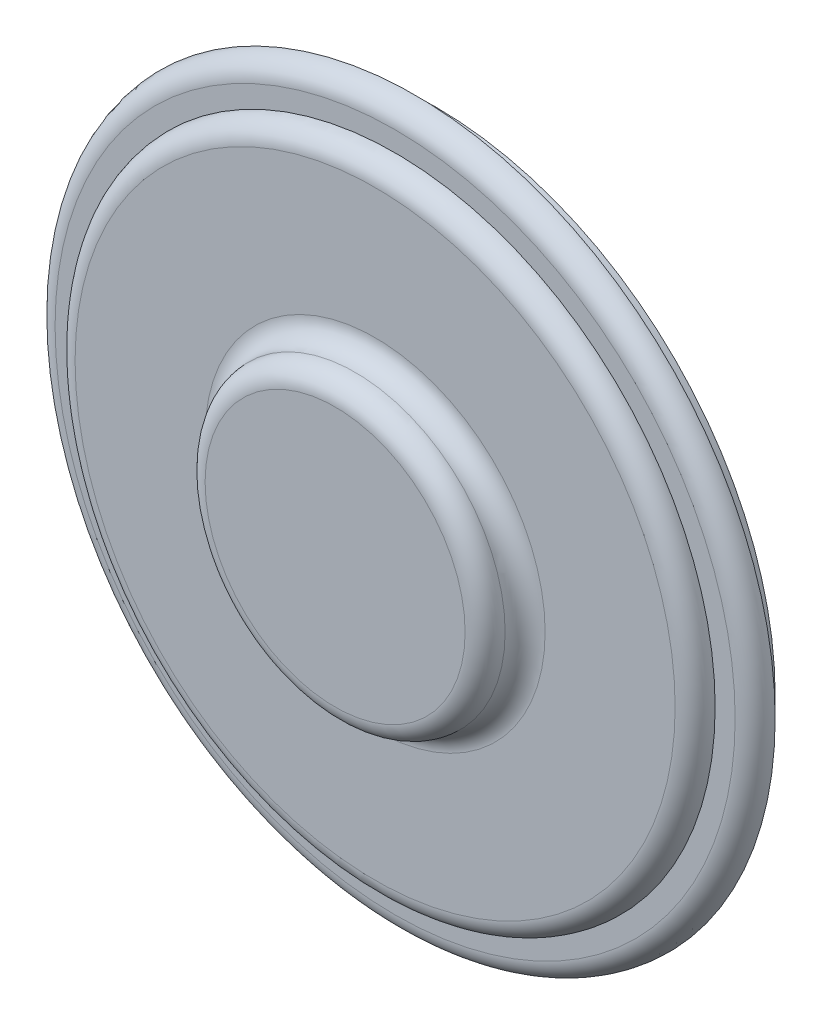
ISO-10303-21;
HEADER;
FILE_DESCRIPTION(('STEP AP214'),'2;1');
FILE_NAME('part.step','',(''),(''),'','','');
FILE_SCHEMA(('AUTOMOTIVE_DESIGN { 1 0 10303 214 1 1 1 1 }'));
ENDSEC;
DATA;
#1=APPLICATION_CONTEXT('core data for automotive mechanical design processes');
#2=APPLICATION_PROTOCOL_DEFINITION('international standard','automotive_design',2000,#1);
#3=PRODUCT_CONTEXT('',#1,'mechanical');
#4=PRODUCT('Part','Part','',(#3));
#5=PRODUCT_RELATED_PRODUCT_CATEGORY('part','',(#4));
#6=PRODUCT_DEFINITION_FORMATION('','',#4);
#7=PRODUCT_DEFINITION_CONTEXT('part definition',#1,'design');
#8=PRODUCT_DEFINITION('design','',#6,#7);
#9=PRODUCT_DEFINITION_SHAPE('','',#8);
#10=(LENGTH_UNIT() NAMED_UNIT(*) SI_UNIT(.MILLI.,.METRE.));
#11=(NAMED_UNIT(*) PLANE_ANGLE_UNIT() SI_UNIT($,.RADIAN.));
#12=(NAMED_UNIT(*) SI_UNIT($,.STERADIAN.) SOLID_ANGLE_UNIT());
#13=UNCERTAINTY_MEASURE_WITH_UNIT(LENGTH_MEASURE(1.E-05),#10,'distance_accuracy_value','');
#14=(GEOMETRIC_REPRESENTATION_CONTEXT(3) GLOBAL_UNCERTAINTY_ASSIGNED_CONTEXT((#13)) GLOBAL_UNIT_ASSIGNED_CONTEXT((#10,
#11,#12)) REPRESENTATION_CONTEXT('',''));
#15=CARTESIAN_POINT('',(0.,0.,0.));
#16=DIRECTION('',(0.,0.,1.));
#17=DIRECTION('',(1.,0.,0.));
#18=AXIS2_PLACEMENT_3D('',#15,#16,#17);
#19=CARTESIAN_POINT('',(0.,0.,2.));
#20=DIRECTION('',(0.,0.,1.));
#21=DIRECTION('',(1.,0.,0.));
#22=AXIS2_PLACEMENT_3D('',#19,#20,#21);
#23=PLANE('',#22);
#24=CARTESIAN_POINT('',(0.,0.,2.));
#25=DIRECTION('',(0.,0.,1.));
#26=DIRECTION('',(1.,0.,0.));
#27=AXIS2_PLACEMENT_3D('',#24,#25,#26);
#28=CIRCLE('',#27,17.);
#29=CARTESIAN_POINT('',(17.,0.,2.));
#30=VERTEX_POINT('',#29);
#31=EDGE_CURVE('E51',#30,#30,#28,.T.);
#32=ORIENTED_EDGE('',*,*,#31,.T.);
#33=EDGE_LOOP('',(#32));
#34=FACE_BOUND('',#33,.T.);
#35=CARTESIAN_POINT('',(0.,0.,2.));
#36=DIRECTION('',(0.,0.,1.));
#37=DIRECTION('',(1.,0.,0.));
#38=AXIS2_PLACEMENT_3D('',#35,#36,#37);
#39=CIRCLE('',#38,16.);
#40=CARTESIAN_POINT('',(16.,0.,2.));
#41=VERTEX_POINT('',#40);
#42=EDGE_CURVE('E60',#41,#41,#39,.T.);
#43=ORIENTED_EDGE('',*,*,#42,.F.);
#44=EDGE_LOOP('',(#43));
#45=FACE_BOUND('',#44,.T.);
#46=ADVANCED_FACE('F39',(#34,#45),#23,.T.);
#47=CARTESIAN_POINT('',(0.,0.,3.));
#48=DIRECTION('',(0.,0.,1.));
#49=DIRECTION('',(1.,0.,0.));
#50=AXIS2_PLACEMENT_3D('',#47,#48,#49);
#51=PLANE('',#50);
#52=CARTESIAN_POINT('',(0.,0.,3.));
#53=DIRECTION('',(0.,0.,1.));
#54=DIRECTION('',(1.,0.,0.));
#55=AXIS2_PLACEMENT_3D('',#52,#53,#54);
#56=CIRCLE('',#55,15.);
#57=CARTESIAN_POINT('',(15.,0.,3.));
#58=VERTEX_POINT('',#57);
#59=EDGE_CURVE('E65',#58,#58,#56,.T.);
#60=ORIENTED_EDGE('',*,*,#59,.T.);
#61=EDGE_LOOP('',(#60));
#62=FACE_BOUND('',#61,.T.);
#63=CARTESIAN_POINT('',(0.,0.,3.));
#64=DIRECTION('',(0.,0.,1.));
#65=DIRECTION('',(1.,0.,0.));
#66=AXIS2_PLACEMENT_3D('',#63,#64,#65);
#67=CIRCLE('',#66,8.5);
#68=CARTESIAN_POINT('',(8.5,0.,3.));
#69=VERTEX_POINT('',#68);
#70=EDGE_CURVE('E68',#69,#69,#67,.F.);
#71=ORIENTED_EDGE('',*,*,#70,.T.);
#72=EDGE_LOOP('',(#71));
#73=FACE_BOUND('',#72,.T.);
#74=ADVANCED_FACE('F118',(#62,#73),#51,.T.);
#75=CARTESIAN_POINT('',(0.,0.,5.));
#76=DIRECTION('',(0.,0.,1.));
#77=DIRECTION('',(1.,0.,0.));
#78=AXIS2_PLACEMENT_3D('',#75,#76,#77);
#79=PLANE('',#78);
#80=CARTESIAN_POINT('',(0.,0.,5.));
#81=DIRECTION('',(0.,0.,1.));
#82=DIRECTION('',(1.,0.,0.));
#83=AXIS2_PLACEMENT_3D('',#80,#81,#82);
#84=CIRCLE('',#83,6.5);
#85=CARTESIAN_POINT('',(6.5,0.,5.));
#86=VERTEX_POINT('',#85);
#87=EDGE_CURVE('E55',#86,#86,#84,.T.);
#88=ORIENTED_EDGE('',*,*,#87,.T.);
#89=EDGE_LOOP('',(#88));
#90=FACE_BOUND('',#89,.T.);
#91=ADVANCED_FACE('F124',(#90),#79,.T.);
#92=CARTESIAN_POINT('',(0.,0.,2.));
#93=DIRECTION('',(0.,0.,1.));
#94=DIRECTION('',(1.,0.,0.));
#95=AXIS2_PLACEMENT_3D('',#92,#93,#94);
#96=TOROIDAL_SURFACE('',#95,15.,1.);
#97=ORIENTED_EDGE('',*,*,#42,.T.);
#98=EDGE_LOOP('',(#97));
#99=FACE_BOUND('',#98,.T.);
#100=ORIENTED_EDGE('',*,*,#59,.F.);
#101=EDGE_LOOP('',(#100));
#102=FACE_BOUND('',#101,.T.);
#103=ADVANCED_FACE('F134',(#99,#102),#96,.T.);
#104=CARTESIAN_POINT('',(0.,0.,4.));
#105=DIRECTION('',(0.,0.,1.));
#106=DIRECTION('',(1.,0.,0.));
#107=AXIS2_PLACEMENT_3D('',#104,#105,#106);
#108=TOROIDAL_SURFACE('',#107,6.5,1.);
#109=ORIENTED_EDGE('',*,*,#87,.F.);
#110=EDGE_LOOP('',(#109));
#111=FACE_BOUND('',#110,.T.);
#112=CARTESIAN_POINT('',(0.,0.,4.));
#113=DIRECTION('',(0.,0.,1.));
#114=DIRECTION('',(1.,0.,0.));
#115=AXIS2_PLACEMENT_3D('',#112,#113,#114);
#116=CIRCLE('',#115,7.5);
#117=CARTESIAN_POINT('',(7.5,0.,4.));
#118=VERTEX_POINT('',#117);
#119=EDGE_CURVE('E58',#118,#118,#116,.F.);
#120=ORIENTED_EDGE('',*,*,#119,.F.);
#121=EDGE_LOOP('',(#120));
#122=FACE_BOUND('',#121,.T.);
#123=ADVANCED_FACE('F137',(#111,#122),#108,.T.);
#124=CARTESIAN_POINT('',(0.,0.,4.));
#125=DIRECTION('',(0.,0.,1.));
#126=DIRECTION('',(1.,0.,0.));
#127=AXIS2_PLACEMENT_3D('',#124,#125,#126);
#128=TOROIDAL_SURFACE('',#127,8.5,1.);
#129=ORIENTED_EDGE('',*,*,#70,.F.);
#130=EDGE_LOOP('',(#129));
#131=FACE_BOUND('',#130,.T.);
#132=ORIENTED_EDGE('',*,*,#119,.T.);
#133=EDGE_LOOP('',(#132));
#134=FACE_BOUND('',#133,.T.);
#135=ADVANCED_FACE('F139',(#131,#134),#128,.F.);
#136=CARTESIAN_POINT('',(0.,0.,1.));
#137=DIRECTION('',(0.,0.,1.));
#138=DIRECTION('',(1.,0.,0.));
#139=AXIS2_PLACEMENT_3D('',#136,#137,#138);
#140=TOROIDAL_SURFACE('',#139,17.,1.);
#141=CARTESIAN_POINT('',(0.,0.,1.));
#142=DIRECTION('',(0.,0.,-1.));
#143=DIRECTION('',(-1.,0.,0.));
#144=AXIS2_PLACEMENT_3D('',#141,#142,#143);
#145=CIRCLE('',#144,18.);
#146=CARTESIAN_POINT('',(-18.,0.,1.));
#147=VERTEX_POINT('',#146);
#148=EDGE_CURVE('E61',#147,#147,#145,.T.);
#149=ORIENTED_EDGE('',*,*,#148,.F.);
#150=EDGE_LOOP('',(#149));
#151=FACE_BOUND('',#150,.T.);
#152=ORIENTED_EDGE('',*,*,#31,.F.);
#153=EDGE_LOOP('',(#152));
#154=FACE_BOUND('',#153,.T.);
#155=ADVANCED_FACE('F142',(#151,#154),#140,.T.);
#156=CARTESIAN_POINT('',(0.,0.,1.));
#157=DIRECTION('',(0.,0.,-1.));
#158=DIRECTION('',(-1.,0.,0.));
#159=AXIS2_PLACEMENT_3D('',#156,#157,#158);
#160=PLANE('',#159);
#161=CARTESIAN_POINT('',(0.,0.,1.));
#162=DIRECTION('',(0.,0.,-1.));
#163=DIRECTION('',(-1.,0.,0.));
#164=AXIS2_PLACEMENT_3D('',#161,#162,#163);
#165=CIRCLE('',#164,17.);
#166=CARTESIAN_POINT('',(-17.,0.,1.));
#167=VERTEX_POINT('',#166);
#168=EDGE_CURVE('E75',#167,#167,#165,.T.);
#169=ORIENTED_EDGE('',*,*,#168,.F.);
#170=EDGE_LOOP('',(#169));
#171=FACE_BOUND('',#170,.T.);
#172=ORIENTED_EDGE('',*,*,#148,.T.);
#173=EDGE_LOOP('',(#172));
#174=FACE_BOUND('',#173,.T.);
#175=ADVANCED_FACE('F148',(#171,#174),#160,.T.);
#176=CARTESIAN_POINT('',(0.,0.,1.));
#177=DIRECTION('',(0.,0.,-1.));
#178=DIRECTION('',(-1.,0.,0.));
#179=AXIS2_PLACEMENT_3D('',#176,#177,#178);
#180=CYLINDRICAL_SURFACE('',#179,17.);
#181=ORIENTED_EDGE('',*,*,#168,.T.);
#182=EDGE_LOOP('',(#181));
#183=FACE_BOUND('',#182,.T.);
#184=CARTESIAN_POINT('',(0.,0.,0.));
#185=DIRECTION('',(0.,0.,-1.));
#186=DIRECTION('',(-1.,0.,0.));
#187=AXIS2_PLACEMENT_3D('',#184,#185,#186);
#188=CIRCLE('',#187,17.);
#189=CARTESIAN_POINT('',(-17.,0.,0.));
#190=VERTEX_POINT('',#189);
#191=EDGE_CURVE('E76',#190,#190,#188,.T.);
#192=ORIENTED_EDGE('',*,*,#191,.F.);
#193=EDGE_LOOP('',(#192));
#194=FACE_BOUND('',#193,.T.);
#195=ADVANCED_FACE('F132',(#183,#194),#180,.T.);
#196=CARTESIAN_POINT('',(0.,0.,0.));
#197=DIRECTION('',(0.,0.,1.));
#198=DIRECTION('',(1.,0.,0.));
#199=AXIS2_PLACEMENT_3D('',#196,#197,#198);
#200=PLANE('',#199);
#201=CARTESIAN_POINT('',(0.,0.,0.));
#202=DIRECTION('',(0.,0.,-1.));
#203=DIRECTION('',(-1.,0.,0.));
#204=AXIS2_PLACEMENT_3D('',#201,#202,#203);
#205=CIRCLE('',#204,15.7894607509045);
#206=CARTESIAN_POINT('',(-15.7894607509045,0.,0.));
#207=VERTEX_POINT('',#206);
#208=EDGE_CURVE('E82',#207,#207,#205,.T.);
#209=ORIENTED_EDGE('',*,*,#208,.F.);
#210=EDGE_LOOP('',(#209));
#211=FACE_BOUND('',#210,.T.);
#212=ORIENTED_EDGE('',*,*,#191,.T.);
#213=EDGE_LOOP('',(#212));
#214=FACE_BOUND('',#213,.T.);
#215=ADVANCED_FACE('F113',(#211,#214),#200,.F.);
#216=CARTESIAN_POINT('',(0.,0.,1.));
#217=DIRECTION('',(0.,0.,-1.));
#218=DIRECTION('',(-1.,0.,0.));
#219=AXIS2_PLACEMENT_3D('',#216,#217,#218);
#220=CYLINDRICAL_SURFACE('',#219,15.7894607509045);
#221=CARTESIAN_POINT('',(0.,0.,1.));
#222=DIRECTION('',(0.,0.,-1.));
#223=DIRECTION('',(-1.,0.,0.));
#224=AXIS2_PLACEMENT_3D('',#221,#222,#223);
#225=CIRCLE('',#224,15.7894607509045);
#226=CARTESIAN_POINT('',(-15.7894607509045,0.,1.));
#227=VERTEX_POINT('',#226);
#228=EDGE_CURVE('E79',#227,#227,#225,.T.);
#229=ORIENTED_EDGE('',*,*,#228,.F.);
#230=EDGE_LOOP('',(#229));
#231=FACE_BOUND('',#230,.T.);
#232=ORIENTED_EDGE('',*,*,#208,.T.);
#233=EDGE_LOOP('',(#232));
#234=FACE_BOUND('',#233,.T.);
#235=ADVANCED_FACE('F131',(#231,#234),#220,.F.);
#236=CARTESIAN_POINT('',(0.,0.,1.));
#237=DIRECTION('',(0.,0.,-1.));
#238=DIRECTION('',(-1.,0.,0.));
#239=AXIS2_PLACEMENT_3D('',#236,#237,#238);
#240=PLANE('',#239);
#241=CARTESIAN_POINT('',(0.,0.,1.));
#242=DIRECTION('',(0.,0.,-1.));
#243=DIRECTION('',(-1.,0.,0.));
#244=AXIS2_PLACEMENT_3D('',#241,#242,#243);
#245=CIRCLE('',#244,13.9322350829918);
#246=CARTESIAN_POINT('',(-13.9322350829918,0.,1.));
#247=VERTEX_POINT('',#246);
#248=EDGE_CURVE('E85',#247,#247,#245,.T.);
#249=ORIENTED_EDGE('',*,*,#248,.F.);
#250=EDGE_LOOP('',(#249));
#251=FACE_BOUND('',#250,.T.);
#252=ORIENTED_EDGE('',*,*,#228,.T.);
#253=EDGE_LOOP('',(#252));
#254=FACE_BOUND('',#253,.T.);
#255=ADVANCED_FACE('F163',(#251,#254),#240,.T.);
#256=CARTESIAN_POINT('',(0.,0.,1.));
#257=DIRECTION('',(0.,0.,-1.));
#258=DIRECTION('',(-1.,0.,0.));
#259=AXIS2_PLACEMENT_3D('',#256,#257,#258);
#260=CYLINDRICAL_SURFACE('',#259,13.9322350829918);
#261=ORIENTED_EDGE('',*,*,#248,.T.);
#262=EDGE_LOOP('',(#261));
#263=FACE_BOUND('',#262,.T.);
#264=CARTESIAN_POINT('',(0.,0.,0.));
#265=DIRECTION('',(0.,0.,-1.));
#266=DIRECTION('',(-1.,0.,0.));
#267=AXIS2_PLACEMENT_3D('',#264,#265,#266);
#268=CIRCLE('',#267,13.9322350829918);
#269=CARTESIAN_POINT('',(-13.9322350829918,0.,0.));
#270=VERTEX_POINT('',#269);
#271=EDGE_CURVE('E88',#270,#270,#268,.T.);
#272=ORIENTED_EDGE('',*,*,#271,.F.);
#273=EDGE_LOOP('',(#272));
#274=FACE_BOUND('',#273,.T.);
#275=ADVANCED_FACE('F114',(#263,#274),#260,.T.);
#276=CARTESIAN_POINT('',(0.,0.,0.));
#277=DIRECTION('',(0.,0.,-1.));
#278=DIRECTION('',(-1.,0.,0.));
#279=AXIS2_PLACEMENT_3D('',#276,#277,#278);
#280=CIRCLE('',#279,12.2316324632965);
#281=CARTESIAN_POINT('',(-12.2316324632965,0.,0.));
#282=VERTEX_POINT('',#281);
#283=EDGE_CURVE('E91',#282,#282,#280,.T.);
#284=ORIENTED_EDGE('',*,*,#283,.F.);
#285=EDGE_LOOP('',(#284));
#286=FACE_BOUND('',#285,.T.);
#287=ORIENTED_EDGE('',*,*,#271,.T.);
#288=EDGE_LOOP('',(#287));
#289=FACE_BOUND('',#288,.T.);
#290=ADVANCED_FACE('F106',(#286,#289),#200,.F.);
#291=CARTESIAN_POINT('',(0.,0.,1.));
#292=DIRECTION('',(0.,0.,-1.));
#293=DIRECTION('',(-1.,0.,0.));
#294=AXIS2_PLACEMENT_3D('',#291,#292,#293);
#295=PLANE('',#294);
#296=CARTESIAN_POINT('',(0.,0.,1.));
#297=DIRECTION('',(0.,0.,-1.));
#298=DIRECTION('',(-1.,0.,0.));
#299=AXIS2_PLACEMENT_3D('',#296,#297,#298);
#300=CIRCLE('',#299,5.11626274091196);
#301=CARTESIAN_POINT('',(-5.11626274091196,0.,1.));
#302=VERTEX_POINT('',#301);
#303=EDGE_CURVE('E10',#302,#302,#300,.T.);
#304=ORIENTED_EDGE('',*,*,#303,.T.);
#305=EDGE_LOOP('',(#304));
#306=FACE_BOUND('',#305,.T.);
#307=CARTESIAN_POINT('',(0.,0.,1.));
#308=DIRECTION('',(0.,0.,-1.));
#309=DIRECTION('',(-1.,0.,0.));
#310=AXIS2_PLACEMENT_3D('',#307,#308,#309);
#311=CIRCLE('',#310,3.89095377608379);
#312=CARTESIAN_POINT('',(-3.89095377608379,0.,1.));
#313=VERTEX_POINT('',#312);
#314=EDGE_CURVE('E96',#313,#313,#311,.T.);
#315=ORIENTED_EDGE('',*,*,#314,.F.);
#316=EDGE_LOOP('',(#315));
#317=FACE_BOUND('',#316,.T.);
#318=ADVANCED_FACE('F103',(#306,#317),#295,.T.);
#319=CARTESIAN_POINT('',(0.,0.,0.));
#320=DIRECTION('',(0.,0.,1.));
#321=DIRECTION('',(1.,0.,0.));
#322=AXIS2_PLACEMENT_3D('',#319,#320,#321);
#323=CIRCLE('',#322,2.89095377608379);
#324=CARTESIAN_POINT('',(2.89095377608379,0.,0.));
#325=VERTEX_POINT('',#324);
#326=EDGE_CURVE('E47',#325,#325,#323,.F.);
#327=ORIENTED_EDGE('',*,*,#326,.T.);
#328=EDGE_LOOP('',(#327));
#329=FACE_BOUND('',#328,.T.);
#330=ADVANCED_FACE('F105',(#329),#200,.F.);
#331=CARTESIAN_POINT('',(0.,0.,1.));
#332=DIRECTION('',(0.,0.,1.));
#333=DIRECTION('',(1.,0.,0.));
#334=AXIS2_PLACEMENT_3D('',#331,#332,#333);
#335=TOROIDAL_SURFACE('',#334,2.89095377608379,1.);
#336=ORIENTED_EDGE('',*,*,#314,.T.);
#337=EDGE_LOOP('',(#336));
#338=FACE_BOUND('',#337,.T.);
#339=ORIENTED_EDGE('',*,*,#326,.F.);
#340=EDGE_LOOP('',(#339));
#341=FACE_BOUND('',#340,.T.);
#342=ADVANCED_FACE('F100',(#338,#341),#335,.T.);
#343=CARTESIAN_POINT('',(0.,0.,1.));
#344=DIRECTION('',(0.,0.,-1.));
#345=DIRECTION('',(-1.,0.,0.));
#346=AXIS2_PLACEMENT_3D('',#343,#344,#345);
#347=CONICAL_SURFACE('',#346,5.11626274091196,1.43116998663536);
#348=ORIENTED_EDGE('',*,*,#283,.T.);
#349=EDGE_LOOP('',(#348));
#350=FACE_BOUND('',#349,.T.);
#351=ORIENTED_EDGE('',*,*,#303,.F.);
#352=EDGE_LOOP('',(#351));
#353=FACE_BOUND('',#352,.T.);
#354=ADVANCED_FACE('F42',(#350,#353),#347,.F.);
#355=CLOSED_SHELL('',(#46,#74,#91,#103,#123,#135,#155,#175,#195,#215,#235,#255,#275,#290,#318,
#330,#342,#354));
#356=MANIFOLD_SOLID_BREP('B2',#355);
#357=ADVANCED_BREP_SHAPE_REPRESENTATION('',(#18,#356),#14);
#358=SHAPE_DEFINITION_REPRESENTATION(#9,#357);
ENDSEC;
END-ISO-10303-21;
